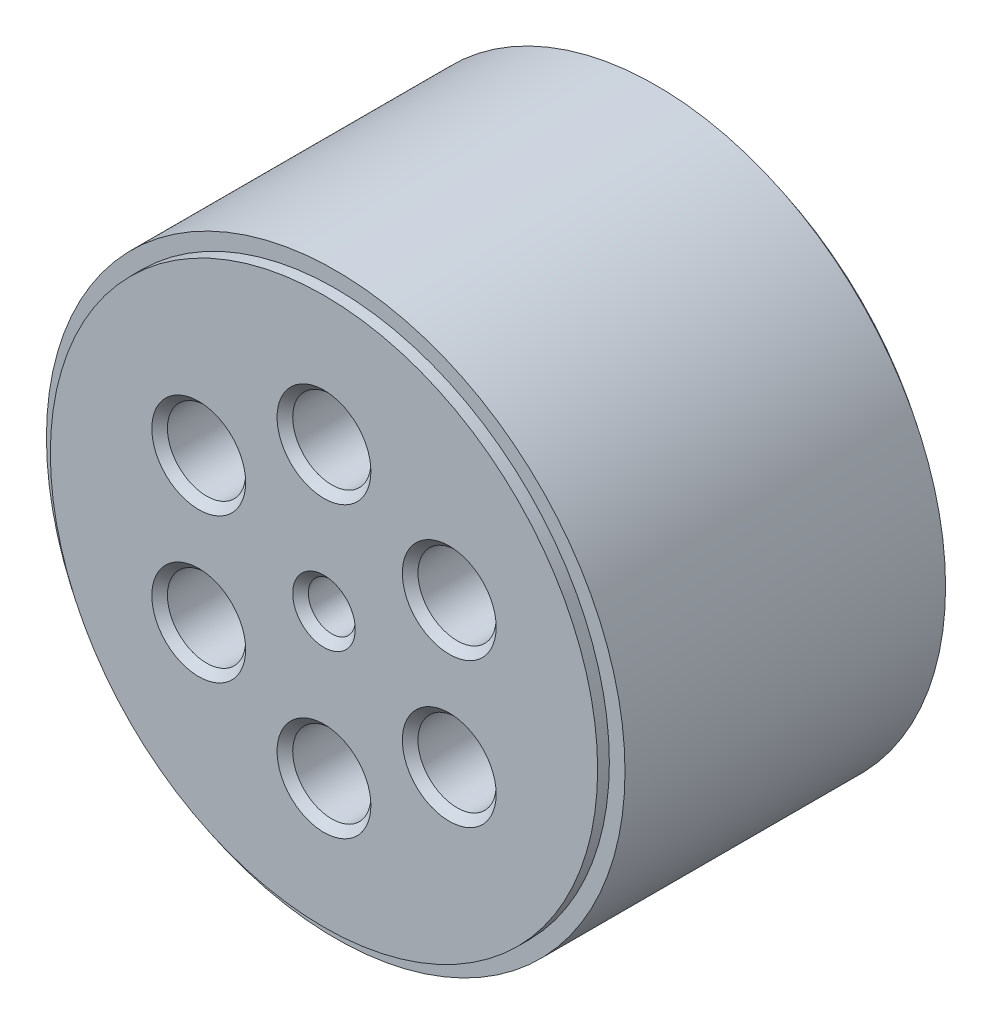
ISO-10303-21;
HEADER;
FILE_DESCRIPTION(('STEP AP214'),'2;1');
FILE_NAME('part.step','',(''),(''),'','','');
FILE_SCHEMA(('AUTOMOTIVE_DESIGN { 1 0 10303 214 1 1 1 1 }'));
ENDSEC;
DATA;
#1=APPLICATION_CONTEXT('core data for automotive mechanical design processes');
#2=APPLICATION_PROTOCOL_DEFINITION('international standard','automotive_design',2000,#1);
#3=PRODUCT_CONTEXT('',#1,'mechanical');
#4=PRODUCT('Part','Part','',(#3));
#5=PRODUCT_RELATED_PRODUCT_CATEGORY('part','',(#4));
#6=PRODUCT_DEFINITION_FORMATION('','',#4);
#7=PRODUCT_DEFINITION_CONTEXT('part definition',#1,'design');
#8=PRODUCT_DEFINITION('design','',#6,#7);
#9=PRODUCT_DEFINITION_SHAPE('','',#8);
#10=(LENGTH_UNIT() NAMED_UNIT(*) SI_UNIT(.MILLI.,.METRE.));
#11=(NAMED_UNIT(*) PLANE_ANGLE_UNIT() SI_UNIT($,.RADIAN.));
#12=(NAMED_UNIT(*) SI_UNIT($,.STERADIAN.) SOLID_ANGLE_UNIT());
#13=UNCERTAINTY_MEASURE_WITH_UNIT(LENGTH_MEASURE(1.E-05),#10,'distance_accuracy_value','');
#14=(GEOMETRIC_REPRESENTATION_CONTEXT(3) GLOBAL_UNCERTAINTY_ASSIGNED_CONTEXT((#13)) GLOBAL_UNIT_ASSIGNED_CONTEXT((#10,
#11,#12)) REPRESENTATION_CONTEXT('',''));
#15=CARTESIAN_POINT('',(0.,0.,0.));
#16=DIRECTION('',(0.,0.,1.));
#17=DIRECTION('',(1.,0.,0.));
#18=AXIS2_PLACEMENT_3D('',#15,#16,#17);
#19=CARTESIAN_POINT('',(0.,0.,22.));
#20=DIRECTION('',(0.,0.,-1.));
#21=DIRECTION('',(-1.,0.,0.));
#22=AXIS2_PLACEMENT_3D('',#19,#20,#21);
#23=CYLINDRICAL_SURFACE('',#22,3.);
#24=CARTESIAN_POINT('',(0.,0.,21.));
#25=DIRECTION('',(0.,0.,1.));
#26=DIRECTION('',(1.,0.,0.));
#27=AXIS2_PLACEMENT_3D('',#24,#25,#26);
#28=CIRCLE('',#27,3.);
#29=CARTESIAN_POINT('',(3.,0.,21.));
#30=VERTEX_POINT('',#29);
#31=EDGE_CURVE('E54',#30,#30,#28,.T.);
#32=ORIENTED_EDGE('',*,*,#31,.T.);
#33=EDGE_LOOP('',(#32));
#34=FACE_BOUND('',#33,.T.);
#35=CARTESIAN_POINT('',(0.,0.,10.));
#36=DIRECTION('',(0.,0.,-1.));
#37=DIRECTION('',(-1.,0.,0.));
#38=AXIS2_PLACEMENT_3D('',#35,#36,#37);
#39=CIRCLE('',#38,3.);
#40=CARTESIAN_POINT('',(-3.,0.,10.));
#41=VERTEX_POINT('',#40);
#42=EDGE_CURVE('E103',#41,#41,#39,.T.);
#43=ORIENTED_EDGE('',*,*,#42,.T.);
#44=EDGE_LOOP('',(#43));
#45=FACE_BOUND('',#44,.T.);
#46=ADVANCED_FACE('F36',(#34,#45),#23,.F.);
#47=CARTESIAN_POINT('',(0.,18.5,22.));
#48=DIRECTION('',(0.,0.,-1.));
#49=DIRECTION('',(-1.,0.,0.));
#50=AXIS2_PLACEMENT_3D('',#47,#48,#49);
#51=CYLINDRICAL_SURFACE('',#50,5.);
#52=CARTESIAN_POINT('',(0.,18.5,21.));
#53=DIRECTION('',(0.,0.,1.));
#54=DIRECTION('',(1.,0.,0.));
#55=AXIS2_PLACEMENT_3D('',#52,#53,#54);
#56=CIRCLE('',#55,5.);
#57=CARTESIAN_POINT('',(5.,18.5,21.));
#58=VERTEX_POINT('',#57);
#59=EDGE_CURVE('E10',#58,#58,#56,.T.);
#60=ORIENTED_EDGE('',*,*,#59,.T.);
#61=EDGE_LOOP('',(#60));
#62=FACE_BOUND('',#61,.T.);
#63=CARTESIAN_POINT('',(0.,18.5,10.));
#64=DIRECTION('',(0.,0.,-1.));
#65=DIRECTION('',(-1.,0.,0.));
#66=AXIS2_PLACEMENT_3D('',#63,#64,#65);
#67=CIRCLE('',#66,5.);
#68=CARTESIAN_POINT('',(-5.,18.5,10.));
#69=VERTEX_POINT('',#68);
#70=EDGE_CURVE('E108',#69,#69,#67,.T.);
#71=ORIENTED_EDGE('',*,*,#70,.T.);
#72=EDGE_LOOP('',(#71));
#73=FACE_BOUND('',#72,.T.);
#74=ADVANCED_FACE('F148',(#62,#73),#51,.F.);
#75=CARTESIAN_POINT('',(16.0214699700121,9.25000000000001,22.));
#76=DIRECTION('',(0.,0.,-1.));
#77=DIRECTION('',(-1.,0.,0.));
#78=AXIS2_PLACEMENT_3D('',#75,#76,#77);
#79=CYLINDRICAL_SURFACE('',#78,5.00000000000005);
#80=CARTESIAN_POINT('',(16.0214699700121,9.25000000000001,21.));
#81=DIRECTION('',(0.,0.,1.));
#82=DIRECTION('',(1.,0.,0.));
#83=AXIS2_PLACEMENT_3D('',#80,#81,#82);
#84=CIRCLE('',#83,5.00000000000005);
#85=CARTESIAN_POINT('',(21.0214699700122,9.25000000000001,21.));
#86=VERTEX_POINT('',#85);
#87=EDGE_CURVE('E45',#86,#86,#84,.T.);
#88=ORIENTED_EDGE('',*,*,#87,.T.);
#89=EDGE_LOOP('',(#88));
#90=FACE_BOUND('',#89,.T.);
#91=CARTESIAN_POINT('',(16.0214699700121,9.25000000000001,10.));
#92=DIRECTION('',(0.,0.,-1.));
#93=DIRECTION('',(-1.,0.,0.));
#94=AXIS2_PLACEMENT_3D('',#91,#92,#93);
#95=CIRCLE('',#94,5.00000000000005);
#96=CARTESIAN_POINT('',(11.0214699700121,9.25000000000001,10.));
#97=VERTEX_POINT('',#96);
#98=EDGE_CURVE('E111',#97,#97,#95,.T.);
#99=ORIENTED_EDGE('',*,*,#98,.T.);
#100=EDGE_LOOP('',(#99));
#101=FACE_BOUND('',#100,.T.);
#102=ADVANCED_FACE('F154',(#90,#101),#79,.F.);
#103=CARTESIAN_POINT('',(16.0214699700127,-9.25000000000035,22.));
#104=DIRECTION('',(0.,0.,-1.));
#105=DIRECTION('',(-1.,0.,0.));
#106=AXIS2_PLACEMENT_3D('',#103,#104,#105);
#107=CYLINDRICAL_SURFACE('',#106,4.99999999999988);
#108=CARTESIAN_POINT('',(16.0214699700127,-9.25000000000035,21.));
#109=DIRECTION('',(0.,0.,1.));
#110=DIRECTION('',(1.,0.,0.));
#111=AXIS2_PLACEMENT_3D('',#108,#109,#110);
#112=CIRCLE('',#111,4.99999999999988);
#113=CARTESIAN_POINT('',(21.0214699700126,-9.25000000000035,21.));
#114=VERTEX_POINT('',#113);
#115=EDGE_CURVE('E49',#114,#114,#112,.T.);
#116=ORIENTED_EDGE('',*,*,#115,.T.);
#117=EDGE_LOOP('',(#116));
#118=FACE_BOUND('',#117,.T.);
#119=CARTESIAN_POINT('',(16.0214699700127,-9.25000000000035,10.));
#120=DIRECTION('',(0.,0.,-1.));
#121=DIRECTION('',(-1.,0.,0.));
#122=AXIS2_PLACEMENT_3D('',#119,#120,#121);
#123=CIRCLE('',#122,4.99999999999988);
#124=CARTESIAN_POINT('',(11.0214699700128,-9.25000000000035,10.));
#125=VERTEX_POINT('',#124);
#126=EDGE_CURVE('E114',#125,#125,#123,.T.);
#127=ORIENTED_EDGE('',*,*,#126,.T.);
#128=EDGE_LOOP('',(#127));
#129=FACE_BOUND('',#128,.T.);
#130=ADVANCED_FACE('F220',(#118,#129),#107,.F.);
#131=CARTESIAN_POINT('',(0.,-18.5,22.));
#132=DIRECTION('',(0.,0.,-1.));
#133=DIRECTION('',(-1.,0.,0.));
#134=AXIS2_PLACEMENT_3D('',#131,#132,#133);
#135=CYLINDRICAL_SURFACE('',#134,5.00000000000013);
#136=CARTESIAN_POINT('',(0.,-18.5,21.));
#137=DIRECTION('',(0.,0.,1.));
#138=DIRECTION('',(1.,0.,0.));
#139=AXIS2_PLACEMENT_3D('',#136,#137,#138);
#140=CIRCLE('',#139,5.00000000000013);
#141=CARTESIAN_POINT('',(5.00000000000013,-18.5,21.));
#142=VERTEX_POINT('',#141);
#143=EDGE_CURVE('E84',#142,#142,#140,.T.);
#144=ORIENTED_EDGE('',*,*,#143,.T.);
#145=EDGE_LOOP('',(#144));
#146=FACE_BOUND('',#145,.T.);
#147=CARTESIAN_POINT('',(0.,-18.5,10.));
#148=DIRECTION('',(0.,0.,-1.));
#149=DIRECTION('',(-1.,0.,0.));
#150=AXIS2_PLACEMENT_3D('',#147,#148,#149);
#151=CIRCLE('',#150,5.00000000000013);
#152=CARTESIAN_POINT('',(-5.00000000000012,-18.5,10.));
#153=VERTEX_POINT('',#152);
#154=EDGE_CURVE('E117',#153,#153,#151,.T.);
#155=ORIENTED_EDGE('',*,*,#154,.T.);
#156=EDGE_LOOP('',(#155));
#157=FACE_BOUND('',#156,.T.);
#158=ADVANCED_FACE('F232',(#146,#157),#135,.F.);
#159=CARTESIAN_POINT('',(-16.0214699700121,-9.2500000000007,22.));
#160=DIRECTION('',(0.,0.,-1.));
#161=DIRECTION('',(-1.,0.,0.));
#162=AXIS2_PLACEMENT_3D('',#159,#160,#161);
#163=CYLINDRICAL_SURFACE('',#162,5.00000000000064);
#164=CARTESIAN_POINT('',(-16.0214699700121,-9.2500000000007,21.));
#165=DIRECTION('',(0.,0.,1.));
#166=DIRECTION('',(1.,0.,0.));
#167=AXIS2_PLACEMENT_3D('',#164,#165,#166);
#168=CIRCLE('',#167,5.00000000000064);
#169=CARTESIAN_POINT('',(-11.0214699700115,-9.2500000000007,21.));
#170=VERTEX_POINT('',#169);
#171=EDGE_CURVE('E60',#170,#170,#168,.T.);
#172=ORIENTED_EDGE('',*,*,#171,.T.);
#173=EDGE_LOOP('',(#172));
#174=FACE_BOUND('',#173,.T.);
#175=CARTESIAN_POINT('',(-16.0214699700121,-9.2500000000007,10.));
#176=DIRECTION('',(0.,0.,-1.));
#177=DIRECTION('',(-1.,0.,0.));
#178=AXIS2_PLACEMENT_3D('',#175,#176,#177);
#179=CIRCLE('',#178,5.00000000000064);
#180=CARTESIAN_POINT('',(-21.0214699700128,-9.2500000000007,10.));
#181=VERTEX_POINT('',#180);
#182=EDGE_CURVE('E120',#181,#181,#179,.T.);
#183=ORIENTED_EDGE('',*,*,#182,.T.);
#184=EDGE_LOOP('',(#183));
#185=FACE_BOUND('',#184,.T.);
#186=ADVANCED_FACE('F230',(#174,#185),#163,.F.);
#187=CARTESIAN_POINT('',(-16.0214699700121,9.24999999999999,22.));
#188=DIRECTION('',(0.,0.,-1.));
#189=DIRECTION('',(-1.,0.,0.));
#190=AXIS2_PLACEMENT_3D('',#187,#188,#189);
#191=CYLINDRICAL_SURFACE('',#190,5.00000000000022);
#192=CARTESIAN_POINT('',(-16.0214699700121,9.24999999999999,21.));
#193=DIRECTION('',(0.,0.,1.));
#194=DIRECTION('',(1.,0.,0.));
#195=AXIS2_PLACEMENT_3D('',#192,#193,#194);
#196=CIRCLE('',#195,5.00000000000022);
#197=CARTESIAN_POINT('',(-11.0214699700119,9.24999999999999,21.));
#198=VERTEX_POINT('',#197);
#199=EDGE_CURVE('E57',#198,#198,#196,.T.);
#200=ORIENTED_EDGE('',*,*,#199,.T.);
#201=EDGE_LOOP('',(#200));
#202=FACE_BOUND('',#201,.T.);
#203=CARTESIAN_POINT('',(-16.0214699700121,9.24999999999999,10.));
#204=DIRECTION('',(0.,0.,-1.));
#205=DIRECTION('',(-1.,0.,0.));
#206=AXIS2_PLACEMENT_3D('',#203,#204,#205);
#207=CIRCLE('',#206,5.00000000000022);
#208=CARTESIAN_POINT('',(-21.0214699700123,9.24999999999999,10.));
#209=VERTEX_POINT('',#208);
#210=EDGE_CURVE('E41',#209,#209,#207,.T.);
#211=ORIENTED_EDGE('',*,*,#210,.T.);
#212=EDGE_LOOP('',(#211));
#213=FACE_BOUND('',#212,.T.);
#214=ADVANCED_FACE('F133',(#202,#213),#191,.F.);
#215=CARTESIAN_POINT('',(0.,0.,-20.5));
#216=DIRECTION('',(0.,0.,-1.));
#217=DIRECTION('',(1.,0.,0.));
#218=AXIS2_PLACEMENT_3D('',#215,#216,#217);
#219=PLANE('',#218);
#220=CARTESIAN_POINT('',(0.,0.,-20.5));
#221=DIRECTION('',(0.,0.,1.));
#222=DIRECTION('',(1.,0.,0.));
#223=AXIS2_PLACEMENT_3D('',#220,#221,#222);
#224=CIRCLE('',#223,37.);
#225=CARTESIAN_POINT('',(37.,0.,-20.5));
#226=VERTEX_POINT('',#225);
#227=EDGE_CURVE('E93',#226,#226,#224,.T.);
#228=ORIENTED_EDGE('',*,*,#227,.F.);
#229=EDGE_LOOP('',(#228));
#230=FACE_BOUND('',#229,.T.);
#231=CARTESIAN_POINT('',(0.,0.,-20.5));
#232=DIRECTION('',(0.,0.,-1.));
#233=DIRECTION('',(-1.,0.,0.));
#234=AXIS2_PLACEMENT_3D('',#231,#232,#233);
#235=CIRCLE('',#234,35.);
#236=CARTESIAN_POINT('',(-35.,0.,-20.5));
#237=VERTEX_POINT('',#236);
#238=EDGE_CURVE('E100',#237,#237,#235,.T.);
#239=ORIENTED_EDGE('',*,*,#238,.F.);
#240=EDGE_LOOP('',(#239));
#241=FACE_BOUND('',#240,.T.);
#242=ADVANCED_FACE('F239',(#230,#241),#219,.T.);
#243=CARTESIAN_POINT('',(0.,0.,-126.651803615609));
#244=DIRECTION('',(0.,0.,1.));
#245=DIRECTION('',(1.,0.,0.));
#246=AXIS2_PLACEMENT_3D('',#243,#244,#245);
#247=CYLINDRICAL_SURFACE('',#246,37.);
#248=CARTESIAN_POINT('',(0.,0.,20.5));
#249=DIRECTION('',(0.,0.,1.));
#250=DIRECTION('',(1.,0.,0.));
#251=AXIS2_PLACEMENT_3D('',#248,#249,#250);
#252=CIRCLE('',#251,37.);
#253=CARTESIAN_POINT('',(37.,0.,20.5));
#254=VERTEX_POINT('',#253);
#255=EDGE_CURVE('E90',#254,#254,#252,.T.);
#256=ORIENTED_EDGE('',*,*,#255,.F.);
#257=EDGE_LOOP('',(#256));
#258=FACE_BOUND('',#257,.T.);
#259=ORIENTED_EDGE('',*,*,#227,.T.);
#260=EDGE_LOOP('',(#259));
#261=FACE_BOUND('',#260,.T.);
#262=ADVANCED_FACE('F167',(#258,#261),#247,.T.);
#263=CARTESIAN_POINT('',(0.,0.,-22.));
#264=DIRECTION('',(0.,0.,1.));
#265=DIRECTION('',(1.,0.,0.));
#266=AXIS2_PLACEMENT_3D('',#263,#264,#265);
#267=PLANE('',#266);
#268=CARTESIAN_POINT('',(0.,0.,-22.));
#269=DIRECTION('',(0.,0.,-1.));
#270=DIRECTION('',(-1.,0.,0.));
#271=AXIS2_PLACEMENT_3D('',#268,#269,#270);
#272=CIRCLE('',#271,29.);
#273=CARTESIAN_POINT('',(-29.,0.,-22.));
#274=VERTEX_POINT('',#273);
#275=EDGE_CURVE('E123',#274,#274,#272,.T.);
#276=ORIENTED_EDGE('',*,*,#275,.F.);
#277=EDGE_LOOP('',(#276));
#278=FACE_BOUND('',#277,.T.);
#279=CARTESIAN_POINT('',(0.,0.,-22.));
#280=DIRECTION('',(0.,0.,1.));
#281=DIRECTION('',(1.,0.,0.));
#282=AXIS2_PLACEMENT_3D('',#279,#280,#281);
#283=CIRCLE('',#282,35.);
#284=CARTESIAN_POINT('',(35.,0.,-22.));
#285=VERTEX_POINT('',#284);
#286=EDGE_CURVE('E99',#285,#285,#283,.T.);
#287=ORIENTED_EDGE('',*,*,#286,.F.);
#288=EDGE_LOOP('',(#287));
#289=FACE_BOUND('',#288,.T.);
#290=ADVANCED_FACE('F163',(#278,#289),#267,.F.);
#291=CARTESIAN_POINT('',(0.,0.,22.));
#292=DIRECTION('',(0.,0.,1.));
#293=DIRECTION('',(1.,0.,0.));
#294=AXIS2_PLACEMENT_3D('',#291,#292,#293);
#295=PLANE('',#294);
#296=CARTESIAN_POINT('',(0.,-18.5,22.));
#297=DIRECTION('',(0.,0.,1.));
#298=DIRECTION('',(1.,0.,0.));
#299=AXIS2_PLACEMENT_3D('',#296,#297,#298);
#300=CIRCLE('',#299,6.00000000000014);
#301=CARTESIAN_POINT('',(6.00000000000015,-18.5,22.));
#302=VERTEX_POINT('',#301);
#303=EDGE_CURVE('E63',#302,#302,#300,.F.);
#304=ORIENTED_EDGE('',*,*,#303,.T.);
#305=EDGE_LOOP('',(#304));
#306=FACE_BOUND('',#305,.T.);
#307=CARTESIAN_POINT('',(-16.0214699700121,-9.2500000000007,22.));
#308=DIRECTION('',(0.,0.,1.));
#309=DIRECTION('',(1.,0.,0.));
#310=AXIS2_PLACEMENT_3D('',#307,#308,#309);
#311=CIRCLE('',#310,6.00000000000067);
#312=CARTESIAN_POINT('',(-10.0214699700114,-9.2500000000007,22.));
#313=VERTEX_POINT('',#312);
#314=EDGE_CURVE('E66',#313,#313,#311,.F.);
#315=ORIENTED_EDGE('',*,*,#314,.T.);
#316=EDGE_LOOP('',(#315));
#317=FACE_BOUND('',#316,.T.);
#318=CARTESIAN_POINT('',(-16.0214699700121,9.24999999999999,22.));
#319=DIRECTION('',(0.,0.,1.));
#320=DIRECTION('',(1.,0.,0.));
#321=AXIS2_PLACEMENT_3D('',#318,#319,#320);
#322=CIRCLE('',#321,6.00000000000024);
#323=CARTESIAN_POINT('',(-10.0214699700119,9.24999999999999,22.));
#324=VERTEX_POINT('',#323);
#325=EDGE_CURVE('E69',#324,#324,#322,.F.);
#326=ORIENTED_EDGE('',*,*,#325,.T.);
#327=EDGE_LOOP('',(#326));
#328=FACE_BOUND('',#327,.T.);
#329=CARTESIAN_POINT('',(0.,0.,22.));
#330=DIRECTION('',(0.,0.,1.));
#331=DIRECTION('',(1.,0.,0.));
#332=AXIS2_PLACEMENT_3D('',#329,#330,#331);
#333=CIRCLE('',#332,3.99999999999999);
#334=CARTESIAN_POINT('',(3.99999999999999,0.,22.));
#335=VERTEX_POINT('',#334);
#336=EDGE_CURVE('E72',#335,#335,#333,.F.);
#337=ORIENTED_EDGE('',*,*,#336,.T.);
#338=EDGE_LOOP('',(#337));
#339=FACE_BOUND('',#338,.T.);
#340=CARTESIAN_POINT('',(16.0214699700127,-9.25000000000035,22.));
#341=DIRECTION('',(0.,0.,1.));
#342=DIRECTION('',(1.,0.,0.));
#343=AXIS2_PLACEMENT_3D('',#340,#341,#342);
#344=CIRCLE('',#343,5.99999999999991);
#345=CARTESIAN_POINT('',(22.0214699700126,-9.25000000000035,22.));
#346=VERTEX_POINT('',#345);
#347=EDGE_CURVE('E75',#346,#346,#344,.F.);
#348=ORIENTED_EDGE('',*,*,#347,.T.);
#349=EDGE_LOOP('',(#348));
#350=FACE_BOUND('',#349,.T.);
#351=CARTESIAN_POINT('',(16.0214699700121,9.25000000000001,22.));
#352=DIRECTION('',(0.,0.,1.));
#353=DIRECTION('',(1.,0.,0.));
#354=AXIS2_PLACEMENT_3D('',#351,#352,#353);
#355=CIRCLE('',#354,6.00000000000006);
#356=CARTESIAN_POINT('',(22.0214699700122,9.25000000000001,22.));
#357=VERTEX_POINT('',#356);
#358=EDGE_CURVE('E78',#357,#357,#355,.F.);
#359=ORIENTED_EDGE('',*,*,#358,.T.);
#360=EDGE_LOOP('',(#359));
#361=FACE_BOUND('',#360,.T.);
#362=CARTESIAN_POINT('',(0.,18.5,22.));
#363=DIRECTION('',(0.,0.,1.));
#364=DIRECTION('',(1.,0.,0.));
#365=AXIS2_PLACEMENT_3D('',#362,#363,#364);
#366=CIRCLE('',#365,6.00000000000003);
#367=CARTESIAN_POINT('',(6.00000000000003,18.5,22.));
#368=VERTEX_POINT('',#367);
#369=EDGE_CURVE('E81',#368,#368,#366,.F.);
#370=ORIENTED_EDGE('',*,*,#369,.T.);
#371=EDGE_LOOP('',(#370));
#372=FACE_BOUND('',#371,.T.);
#373=CARTESIAN_POINT('',(0.,0.,22.));
#374=DIRECTION('',(0.,0.,1.));
#375=DIRECTION('',(1.,0.,0.));
#376=AXIS2_PLACEMENT_3D('',#373,#374,#375);
#377=CIRCLE('',#376,35.);
#378=CARTESIAN_POINT('',(35.,0.,22.));
#379=VERTEX_POINT('',#378);
#380=EDGE_CURVE('E96',#379,#379,#377,.T.);
#381=ORIENTED_EDGE('',*,*,#380,.T.);
#382=EDGE_LOOP('',(#381));
#383=FACE_BOUND('',#382,.T.);
#384=ADVANCED_FACE('F159',(#306,#317,#328,#339,#350,#361,#372,#383),#295,.T.);
#385=CARTESIAN_POINT('',(0.,0.,20.5));
#386=DIRECTION('',(0.,0.,1.));
#387=DIRECTION('',(1.,0.,0.));
#388=AXIS2_PLACEMENT_3D('',#385,#386,#387);
#389=PLANE('',#388);
#390=CARTESIAN_POINT('',(0.,0.,20.5));
#391=DIRECTION('',(0.,0.,1.));
#392=DIRECTION('',(1.,0.,0.));
#393=AXIS2_PLACEMENT_3D('',#390,#391,#392);
#394=CIRCLE('',#393,35.);
#395=CARTESIAN_POINT('',(35.,0.,20.5));
#396=VERTEX_POINT('',#395);
#397=EDGE_CURVE('E87',#396,#396,#394,.T.);
#398=ORIENTED_EDGE('',*,*,#397,.F.);
#399=EDGE_LOOP('',(#398));
#400=FACE_BOUND('',#399,.T.);
#401=ORIENTED_EDGE('',*,*,#255,.T.);
#402=EDGE_LOOP('',(#401));
#403=FACE_BOUND('',#402,.T.);
#404=ADVANCED_FACE('F162',(#400,#403),#389,.T.);
#405=CARTESIAN_POINT('',(0.,0.,-78.4949493661167));
#406=DIRECTION('',(0.,0.,1.));
#407=DIRECTION('',(1.,0.,0.));
#408=AXIS2_PLACEMENT_3D('',#405,#406,#407);
#409=CYLINDRICAL_SURFACE('',#408,35.);
#410=ORIENTED_EDGE('',*,*,#397,.T.);
#411=EDGE_LOOP('',(#410));
#412=FACE_BOUND('',#411,.T.);
#413=ORIENTED_EDGE('',*,*,#380,.F.);
#414=EDGE_LOOP('',(#413));
#415=FACE_BOUND('',#414,.T.);
#416=ADVANCED_FACE('F381',(#412,#415),#409,.T.);
#417=CARTESIAN_POINT('',(0.,0.,119.494949366117));
#418=DIRECTION('',(0.,0.,-1.));
#419=DIRECTION('',(-1.,0.,0.));
#420=AXIS2_PLACEMENT_3D('',#417,#418,#419);
#421=CYLINDRICAL_SURFACE('',#420,35.);
#422=ORIENTED_EDGE('',*,*,#238,.T.);
#423=EDGE_LOOP('',(#422));
#424=FACE_BOUND('',#423,.T.);
#425=ORIENTED_EDGE('',*,*,#286,.T.);
#426=EDGE_LOOP('',(#425));
#427=FACE_BOUND('',#426,.T.);
#428=ADVANCED_FACE('F177',(#424,#427),#421,.T.);
#429=CARTESIAN_POINT('',(0.,-18.5,21.));
#430=DIRECTION('',(0.,0.,1.));
#431=DIRECTION('',(1.,0.,0.));
#432=AXIS2_PLACEMENT_3D('',#429,#430,#431);
#433=CONICAL_SURFACE('',#432,5.00000000000013,0.785398163397446);
#434=ORIENTED_EDGE('',*,*,#303,.F.);
#435=EDGE_LOOP('',(#434));
#436=FACE_BOUND('',#435,.T.);
#437=ORIENTED_EDGE('',*,*,#143,.F.);
#438=EDGE_LOOP('',(#437));
#439=FACE_BOUND('',#438,.T.);
#440=ADVANCED_FACE('F170',(#436,#439),#433,.F.);
#441=CARTESIAN_POINT('',(-16.0214699700121,-9.2500000000007,21.));
#442=DIRECTION('',(0.,0.,1.));
#443=DIRECTION('',(1.,0.,0.));
#444=AXIS2_PLACEMENT_3D('',#441,#442,#443);
#445=CONICAL_SURFACE('',#444,5.00000000000064,0.785398163397447);
#446=ORIENTED_EDGE('',*,*,#314,.F.);
#447=EDGE_LOOP('',(#446));
#448=FACE_BOUND('',#447,.T.);
#449=ORIENTED_EDGE('',*,*,#171,.F.);
#450=EDGE_LOOP('',(#449));
#451=FACE_BOUND('',#450,.T.);
#452=ADVANCED_FACE('F176',(#448,#451),#445,.F.);
#453=CARTESIAN_POINT('',(-16.0214699700121,9.24999999999999,21.));
#454=DIRECTION('',(0.,0.,1.));
#455=DIRECTION('',(1.,0.,0.));
#456=AXIS2_PLACEMENT_3D('',#453,#454,#455);
#457=CONICAL_SURFACE('',#456,5.00000000000022,0.785398163397446);
#458=ORIENTED_EDGE('',*,*,#325,.F.);
#459=EDGE_LOOP('',(#458));
#460=FACE_BOUND('',#459,.T.);
#461=ORIENTED_EDGE('',*,*,#199,.F.);
#462=EDGE_LOOP('',(#461));
#463=FACE_BOUND('',#462,.T.);
#464=ADVANCED_FACE('F184',(#460,#463),#457,.F.);
#465=CARTESIAN_POINT('',(0.,0.,21.));
#466=DIRECTION('',(0.,0.,1.));
#467=DIRECTION('',(1.,0.,0.));
#468=AXIS2_PLACEMENT_3D('',#465,#466,#467);
#469=CONICAL_SURFACE('',#468,3.,0.785398163397449);
#470=ORIENTED_EDGE('',*,*,#336,.F.);
#471=EDGE_LOOP('',(#470));
#472=FACE_BOUND('',#471,.T.);
#473=ORIENTED_EDGE('',*,*,#31,.F.);
#474=EDGE_LOOP('',(#473));
#475=FACE_BOUND('',#474,.T.);
#476=ADVANCED_FACE('F191',(#472,#475),#469,.F.);
#477=CARTESIAN_POINT('',(16.0214699700127,-9.25000000000035,21.));
#478=DIRECTION('',(0.,0.,1.));
#479=DIRECTION('',(1.,0.,0.));
#480=AXIS2_PLACEMENT_3D('',#477,#478,#479);
#481=CONICAL_SURFACE('',#480,4.99999999999988,0.785398163397447);
#482=ORIENTED_EDGE('',*,*,#347,.F.);
#483=EDGE_LOOP('',(#482));
#484=FACE_BOUND('',#483,.T.);
#485=ORIENTED_EDGE('',*,*,#115,.F.);
#486=EDGE_LOOP('',(#485));
#487=FACE_BOUND('',#486,.T.);
#488=ADVANCED_FACE('F198',(#484,#487),#481,.F.);
#489=CARTESIAN_POINT('',(16.0214699700121,9.25000000000001,21.));
#490=DIRECTION('',(0.,0.,1.));
#491=DIRECTION('',(1.,0.,0.));
#492=AXIS2_PLACEMENT_3D('',#489,#490,#491);
#493=CONICAL_SURFACE('',#492,5.00000000000005,0.785398163397446);
#494=ORIENTED_EDGE('',*,*,#358,.F.);
#495=EDGE_LOOP('',(#494));
#496=FACE_BOUND('',#495,.T.);
#497=ORIENTED_EDGE('',*,*,#87,.F.);
#498=EDGE_LOOP('',(#497));
#499=FACE_BOUND('',#498,.T.);
#500=ADVANCED_FACE('F204',(#496,#499),#493,.F.);
#501=CARTESIAN_POINT('',(0.,18.5,21.));
#502=DIRECTION('',(0.,0.,1.));
#503=DIRECTION('',(1.,0.,0.));
#504=AXIS2_PLACEMENT_3D('',#501,#502,#503);
#505=CONICAL_SURFACE('',#504,5.,0.785398163397453);
#506=ORIENTED_EDGE('',*,*,#369,.F.);
#507=EDGE_LOOP('',(#506));
#508=FACE_BOUND('',#507,.T.);
#509=ORIENTED_EDGE('',*,*,#59,.F.);
#510=EDGE_LOOP('',(#509));
#511=FACE_BOUND('',#510,.T.);
#512=ADVANCED_FACE('F39',(#508,#511),#505,.F.);
#513=CARTESIAN_POINT('',(0.,0.,10.));
#514=DIRECTION('',(0.,0.,-1.));
#515=DIRECTION('',(-1.,0.,0.));
#516=AXIS2_PLACEMENT_3D('',#513,#514,#515);
#517=CYLINDRICAL_SURFACE('',#516,29.);
#518=CARTESIAN_POINT('',(0.,0.,10.));
#519=DIRECTION('',(0.,0.,-1.));
#520=DIRECTION('',(-1.,0.,0.));
#521=AXIS2_PLACEMENT_3D('',#518,#519,#520);
#522=CIRCLE('',#521,29.);
#523=CARTESIAN_POINT('',(-29.,0.,10.));
#524=VERTEX_POINT('',#523);
#525=EDGE_CURVE('E126',#524,#524,#522,.T.);
#526=ORIENTED_EDGE('',*,*,#525,.F.);
#527=EDGE_LOOP('',(#526));
#528=FACE_BOUND('',#527,.T.);
#529=ORIENTED_EDGE('',*,*,#275,.T.);
#530=EDGE_LOOP('',(#529));
#531=FACE_BOUND('',#530,.T.);
#532=ADVANCED_FACE('F137',(#528,#531),#517,.F.);
#533=CARTESIAN_POINT('',(0.,0.,10.));
#534=DIRECTION('',(0.,0.,-1.));
#535=DIRECTION('',(-1.,0.,0.));
#536=AXIS2_PLACEMENT_3D('',#533,#534,#535);
#537=PLANE('',#536);
#538=ORIENTED_EDGE('',*,*,#42,.F.);
#539=EDGE_LOOP('',(#538));
#540=FACE_BOUND('',#539,.T.);
#541=ORIENTED_EDGE('',*,*,#70,.F.);
#542=EDGE_LOOP('',(#541));
#543=FACE_BOUND('',#542,.T.);
#544=ORIENTED_EDGE('',*,*,#98,.F.);
#545=EDGE_LOOP('',(#544));
#546=FACE_BOUND('',#545,.T.);
#547=ORIENTED_EDGE('',*,*,#126,.F.);
#548=EDGE_LOOP('',(#547));
#549=FACE_BOUND('',#548,.T.);
#550=ORIENTED_EDGE('',*,*,#154,.F.);
#551=EDGE_LOOP('',(#550));
#552=FACE_BOUND('',#551,.T.);
#553=ORIENTED_EDGE('',*,*,#182,.F.);
#554=EDGE_LOOP('',(#553));
#555=FACE_BOUND('',#554,.T.);
#556=ORIENTED_EDGE('',*,*,#210,.F.);
#557=EDGE_LOOP('',(#556));
#558=FACE_BOUND('',#557,.T.);
#559=ORIENTED_EDGE('',*,*,#525,.T.);
#560=EDGE_LOOP('',(#559));
#561=FACE_BOUND('',#560,.T.);
#562=ADVANCED_FACE('F135',(#540,#543,#546,#549,#552,#555,#558,#561),#537,.T.);
#563=CLOSED_SHELL('',(#46,#74,#102,#130,#158,#186,#214,#242,#262,#290,#384,#404,#416,#428,#440,
#452,#464,#476,#488,#500,#512,#532,#562));
#564=MANIFOLD_SOLID_BREP('B2',#563);
#565=ADVANCED_BREP_SHAPE_REPRESENTATION('',(#18,#564),#14);
#566=SHAPE_DEFINITION_REPRESENTATION(#9,#565);
ENDSEC;
END-ISO-10303-21;
